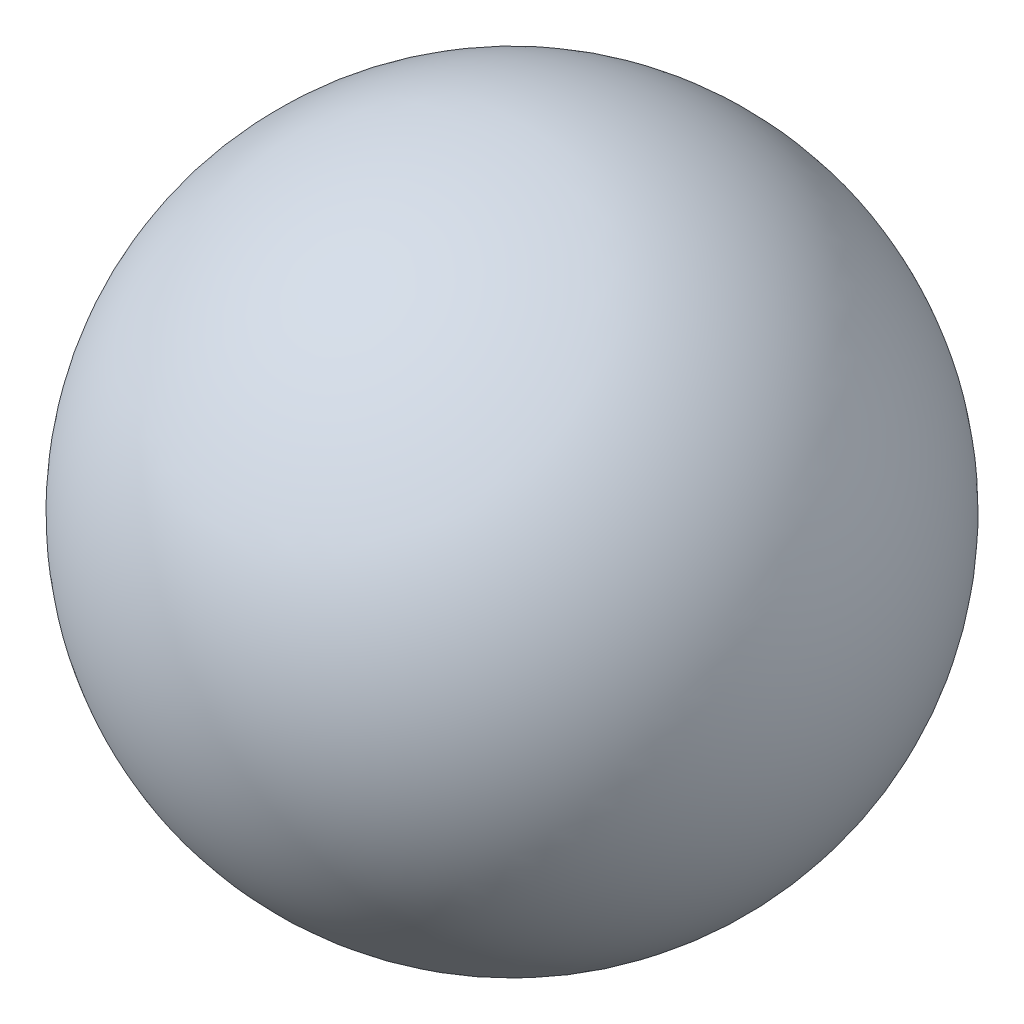
ISO-10303-21;
HEADER;
FILE_DESCRIPTION(('STEP AP214'),'2;1');
FILE_NAME('part.step','',(''),(''),'','','');
FILE_SCHEMA(('AUTOMOTIVE_DESIGN { 1 0 10303 214 1 1 1 1 }'));
ENDSEC;
DATA;
#1=APPLICATION_CONTEXT('core data for automotive mechanical design processes');
#2=APPLICATION_PROTOCOL_DEFINITION('international standard','automotive_design',2000,#1);
#3=PRODUCT_CONTEXT('',#1,'mechanical');
#4=PRODUCT('Part','Part','',(#3));
#5=PRODUCT_RELATED_PRODUCT_CATEGORY('part','',(#4));
#6=PRODUCT_DEFINITION_FORMATION('','',#4);
#7=PRODUCT_DEFINITION_CONTEXT('part definition',#1,'design');
#8=PRODUCT_DEFINITION('design','',#6,#7);
#9=PRODUCT_DEFINITION_SHAPE('','',#8);
#10=(LENGTH_UNIT() NAMED_UNIT(*) SI_UNIT(.MILLI.,.METRE.));
#11=(NAMED_UNIT(*) PLANE_ANGLE_UNIT() SI_UNIT($,.RADIAN.));
#12=(NAMED_UNIT(*) SI_UNIT($,.STERADIAN.) SOLID_ANGLE_UNIT());
#13=UNCERTAINTY_MEASURE_WITH_UNIT(LENGTH_MEASURE(1.E-05),#10,'distance_accuracy_value','');
#14=(GEOMETRIC_REPRESENTATION_CONTEXT(3) GLOBAL_UNCERTAINTY_ASSIGNED_CONTEXT((#13)) GLOBAL_UNIT_ASSIGNED_CONTEXT((#10,
#11,#12)) REPRESENTATION_CONTEXT('',''));
#15=CARTESIAN_POINT('',(0.,0.,0.));
#16=DIRECTION('',(0.,0.,1.));
#17=DIRECTION('',(1.,0.,0.));
#18=AXIS2_PLACEMENT_3D('',#15,#16,#17);
#19=CARTESIAN_POINT('',(-11.4187859278016,-2.,2.77016749223577));
#20=DIRECTION('',(0.,0.,1.));
#21=DIRECTION('',(1.,0.,0.));
#22=AXIS2_PLACEMENT_3D('',#19,#20,#21);
#23=SPHERICAL_SURFACE('',#22,1.05);
#24=CARTESIAN_POINT('',(-11.4187859278016,-2.,3.82016749223577));
#25=VERTEX_POINT('',#24);
#26=VERTEX_LOOP('',#25);
#27=FACE_BOUND('',#26,.T.);
#28=ADVANCED_FACE('F13',(#27),#23,.T.);
#29=CLOSED_SHELL('',(#28));
#30=MANIFOLD_SOLID_BREP('B1',#29);
#31=ADVANCED_BREP_SHAPE_REPRESENTATION('',(#18,#30),#14);
#32=SHAPE_DEFINITION_REPRESENTATION(#9,#31);
ENDSEC;
END-ISO-10303-21;
